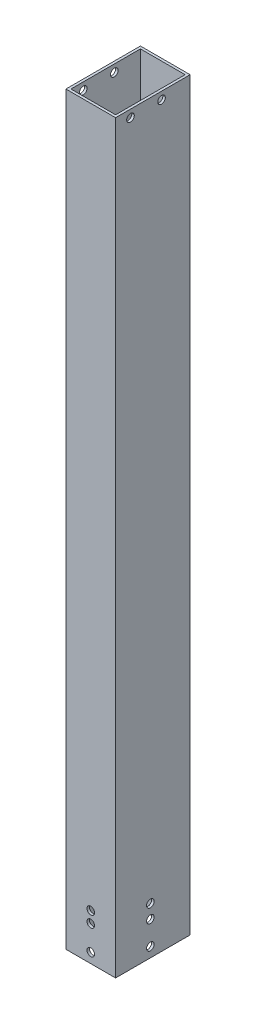
ISO-10303-21;
HEADER;
FILE_DESCRIPTION(('STEP AP214'),'2;1');
FILE_NAME('part.step','',(''),(''),'','','');
FILE_SCHEMA(('AUTOMOTIVE_DESIGN { 1 0 10303 214 1 1 1 1 }'));
ENDSEC;
DATA;
#1=APPLICATION_CONTEXT('core data for automotive mechanical design processes');
#2=APPLICATION_PROTOCOL_DEFINITION('international standard','automotive_design',2000,#1);
#3=PRODUCT_CONTEXT('',#1,'mechanical');
#4=PRODUCT('Part','Part','',(#3));
#5=PRODUCT_RELATED_PRODUCT_CATEGORY('part','',(#4));
#6=PRODUCT_DEFINITION_FORMATION('','',#4);
#7=PRODUCT_DEFINITION_CONTEXT('part definition',#1,'design');
#8=PRODUCT_DEFINITION('design','',#6,#7);
#9=PRODUCT_DEFINITION_SHAPE('','',#8);
#10=(LENGTH_UNIT() NAMED_UNIT(*) SI_UNIT(.MILLI.,.METRE.));
#11=(NAMED_UNIT(*) PLANE_ANGLE_UNIT() SI_UNIT($,.RADIAN.));
#12=(NAMED_UNIT(*) SI_UNIT($,.STERADIAN.) SOLID_ANGLE_UNIT());
#13=UNCERTAINTY_MEASURE_WITH_UNIT(LENGTH_MEASURE(1.E-05),#10,'distance_accuracy_value','');
#14=(GEOMETRIC_REPRESENTATION_CONTEXT(3) GLOBAL_UNCERTAINTY_ASSIGNED_CONTEXT((#13)) GLOBAL_UNIT_ASSIGNED_CONTEXT((#10,
#11,#12)) REPRESENTATION_CONTEXT('',''));
#15=CARTESIAN_POINT('',(0.,0.,0.));
#16=DIRECTION('',(0.,0.,1.));
#17=DIRECTION('',(1.,0.,0.));
#18=AXIS2_PLACEMENT_3D('',#15,#16,#17);
#19=CARTESIAN_POINT('',(10.,150.,15.));
#20=DIRECTION('',(-1.,0.,0.));
#21=DIRECTION('',(0.,0.,1.));
#22=AXIS2_PLACEMENT_3D('',#19,#20,#21);
#23=PLANE('',#22);
#24=CARTESIAN_POINT('',(10.,147.,9.0000000000055));
#25=DIRECTION('',(-1.,0.,0.));
#26=DIRECTION('',(0.,0.,1.));
#27=AXIS2_PLACEMENT_3D('',#24,#25,#26);
#28=CIRCLE('',#27,1.52499999991925);
#29=CARTESIAN_POINT('',(10.,147.,10.5249999999247));
#30=VERTEX_POINT('',#29);
#31=EDGE_CURVE('E191',#30,#30,#28,.T.);
#32=ORIENTED_EDGE('',*,*,#31,.T.);
#33=EDGE_LOOP('',(#32));
#34=FACE_BOUND('',#33,.T.);
#35=CARTESIAN_POINT('',(10.,147.,-3.49999999999451));
#36=DIRECTION('',(-1.,0.,0.));
#37=DIRECTION('',(0.,0.,1.));
#38=AXIS2_PLACEMENT_3D('',#35,#36,#37);
#39=CIRCLE('',#38,1.52499999991925);
#40=CARTESIAN_POINT('',(10.,147.,-1.97500000007526));
#41=VERTEX_POINT('',#40);
#42=EDGE_CURVE('E202',#41,#41,#39,.T.);
#43=ORIENTED_EDGE('',*,*,#42,.T.);
#44=EDGE_LOOP('',(#43));
#45=FACE_BOUND('',#44,.T.);
#46=CARTESIAN_POINT('',(10.,-136.499999999993,1.00000000000101));
#47=DIRECTION('',(1.,0.,0.));
#48=DIRECTION('',(0.,0.,-1.));
#49=AXIS2_PLACEMENT_3D('',#46,#47,#48);
#50=CIRCLE('',#49,1.52500000003684);
#51=CARTESIAN_POINT('',(10.,-136.499999999993,-0.525000000035833));
#52=VERTEX_POINT('',#51);
#53=EDGE_CURVE('E213',#52,#52,#50,.T.);
#54=ORIENTED_EDGE('',*,*,#53,.F.);
#55=EDGE_LOOP('',(#54));
#56=FACE_BOUND('',#55,.T.);
#57=CARTESIAN_POINT('',(10.,-130.999999999994,1.00000000000022));
#58=DIRECTION('',(1.,0.,0.));
#59=DIRECTION('',(0.,0.,-1.));
#60=AXIS2_PLACEMENT_3D('',#57,#58,#59);
#61=CIRCLE('',#60,1.52500000001426);
#62=CARTESIAN_POINT('',(10.,-130.999999999994,-0.525000000014038));
#63=VERTEX_POINT('',#62);
#64=EDGE_CURVE('E226',#63,#63,#61,.T.);
#65=ORIENTED_EDGE('',*,*,#64,.F.);
#66=EDGE_LOOP('',(#65));
#67=FACE_BOUND('',#66,.T.);
#68=CARTESIAN_POINT('',(10.,-146.,1.));
#69=DIRECTION('',(1.,0.,0.));
#70=DIRECTION('',(0.,0.,-1.));
#71=AXIS2_PLACEMENT_3D('',#68,#69,#70);
#72=CIRCLE('',#71,1.52500000000001);
#73=CARTESIAN_POINT('',(10.,-146.,-0.525000000000009));
#74=VERTEX_POINT('',#73);
#75=EDGE_CURVE('E247',#74,#74,#72,.T.);
#76=ORIENTED_EDGE('',*,*,#75,.F.);
#77=EDGE_LOOP('',(#76));
#78=FACE_BOUND('',#77,.T.);
#79=DIRECTION('',(0.,0.,-1.));
#80=VECTOR('',#79,1.);
#81=CARTESIAN_POINT('',(10.,-150.,15.));
#82=LINE('',#81,#80);
#83=CARTESIAN_POINT('',(10.,-150.,15.));
#84=VERTEX_POINT('',#83);
#85=CARTESIAN_POINT('',(10.,-150.,-15.));
#86=VERTEX_POINT('',#85);
#87=EDGE_CURVE('E136',#84,#86,#82,.T.);
#88=ORIENTED_EDGE('',*,*,#87,.T.);
#89=DIRECTION('',(0.,-1.,0.));
#90=VECTOR('',#89,1.);
#91=CARTESIAN_POINT('',(10.,150.,-15.));
#92=LINE('',#91,#90);
#93=CARTESIAN_POINT('',(10.,150.,-15.));
#94=VERTEX_POINT('',#93);
#95=EDGE_CURVE('E12',#94,#86,#92,.T.);
#96=ORIENTED_EDGE('',*,*,#95,.F.);
#97=DIRECTION('',(0.,0.,-1.));
#98=VECTOR('',#97,1.);
#99=CARTESIAN_POINT('',(10.,150.,15.));
#100=LINE('',#99,#98);
#101=CARTESIAN_POINT('',(10.,150.,15.));
#102=VERTEX_POINT('',#101);
#103=EDGE_CURVE('E140',#102,#94,#100,.T.);
#104=ORIENTED_EDGE('',*,*,#103,.F.);
#105=DIRECTION('',(0.,-1.,0.));
#106=VECTOR('',#105,1.);
#107=CARTESIAN_POINT('',(10.,150.,15.));
#108=LINE('',#107,#106);
#109=EDGE_CURVE('E150',#102,#84,#108,.T.);
#110=ORIENTED_EDGE('',*,*,#109,.T.);
#111=EDGE_LOOP('',(#88,#96,#104,#110));
#112=FACE_BOUND('',#111,.T.);
#113=ADVANCED_FACE('F34',(#34,#45,#56,#67,#78,#112),#23,.F.);
#114=CARTESIAN_POINT('',(-10.,150.,-15.));
#115=DIRECTION('',(0.,0.,1.));
#116=DIRECTION('',(1.,0.,0.));
#117=AXIS2_PLACEMENT_3D('',#114,#115,#116);
#118=PLANE('',#117);
#119=CARTESIAN_POINT('',(-6.65916974340597E-13,-136.,-15.));
#120=DIRECTION('',(0.,0.,1.));
#121=DIRECTION('',(1.,0.,0.));
#122=AXIS2_PLACEMENT_3D('',#119,#120,#121);
#123=CIRCLE('',#122,1.52500000000003);
#124=CARTESIAN_POINT('',(1.52499999999936,-136.,-15.));
#125=VERTEX_POINT('',#124);
#126=EDGE_CURVE('E178',#125,#125,#123,.T.);
#127=ORIENTED_EDGE('',*,*,#126,.T.);
#128=EDGE_LOOP('',(#127));
#129=FACE_BOUND('',#128,.T.);
#130=CARTESIAN_POINT('',(0.,-146.,-15.));
#131=DIRECTION('',(0.,0.,1.));
#132=DIRECTION('',(1.,0.,0.));
#133=AXIS2_PLACEMENT_3D('',#130,#131,#132);
#134=CIRCLE('',#133,1.52500000000001);
#135=CARTESIAN_POINT('',(1.52500000000001,-146.,-15.));
#136=VERTEX_POINT('',#135);
#137=EDGE_CURVE('E173',#136,#136,#134,.T.);
#138=ORIENTED_EDGE('',*,*,#137,.T.);
#139=EDGE_LOOP('',(#138));
#140=FACE_BOUND('',#139,.T.);
#141=DIRECTION('',(-1.,0.,0.));
#142=VECTOR('',#141,1.);
#143=CARTESIAN_POINT('',(-10.,-150.,-15.));
#144=LINE('',#143,#142);
#145=CARTESIAN_POINT('',(-10.,-150.,-15.));
#146=VERTEX_POINT('',#145);
#147=EDGE_CURVE('E153',#86,#146,#144,.T.);
#148=ORIENTED_EDGE('',*,*,#147,.T.);
#149=DIRECTION('',(0.,-1.,0.));
#150=VECTOR('',#149,1.);
#151=CARTESIAN_POINT('',(-10.,150.,-15.));
#152=LINE('',#151,#150);
#153=CARTESIAN_POINT('',(-10.,150.,-15.));
#154=VERTEX_POINT('',#153);
#155=EDGE_CURVE('E42',#154,#146,#152,.T.);
#156=ORIENTED_EDGE('',*,*,#155,.F.);
#157=DIRECTION('',(-1.,0.,0.));
#158=VECTOR('',#157,1.);
#159=CARTESIAN_POINT('',(-10.,150.,-15.));
#160=LINE('',#159,#158);
#161=EDGE_CURVE('E143',#94,#154,#160,.T.);
#162=ORIENTED_EDGE('',*,*,#161,.F.);
#163=ORIENTED_EDGE('',*,*,#95,.T.);
#164=EDGE_LOOP('',(#148,#156,#162,#163));
#165=FACE_BOUND('',#164,.T.);
#166=ADVANCED_FACE('F257',(#129,#140,#165),#118,.F.);
#167=CARTESIAN_POINT('',(-10.,150.,15.));
#168=DIRECTION('',(1.,0.,0.));
#169=DIRECTION('',(0.,0.,-1.));
#170=AXIS2_PLACEMENT_3D('',#167,#168,#169);
#171=PLANE('',#170);
#172=CARTESIAN_POINT('',(-10.,147.,9.0000000000055));
#173=DIRECTION('',(-1.,0.,0.));
#174=DIRECTION('',(0.,0.,1.));
#175=AXIS2_PLACEMENT_3D('',#172,#173,#174);
#176=CIRCLE('',#175,1.52499999991925);
#177=CARTESIAN_POINT('',(-10.,147.,10.5249999999247));
#178=VERTEX_POINT('',#177);
#179=EDGE_CURVE('E197',#178,#178,#176,.T.);
#180=ORIENTED_EDGE('',*,*,#179,.F.);
#181=EDGE_LOOP('',(#180));
#182=FACE_BOUND('',#181,.T.);
#183=CARTESIAN_POINT('',(-10.,147.,-3.49999999999451));
#184=DIRECTION('',(-1.,0.,0.));
#185=DIRECTION('',(0.,0.,1.));
#186=AXIS2_PLACEMENT_3D('',#183,#184,#185);
#187=CIRCLE('',#186,1.52499999991925);
#188=CARTESIAN_POINT('',(-10.,147.,-1.97500000007526));
#189=VERTEX_POINT('',#188);
#190=EDGE_CURVE('E205',#189,#189,#187,.T.);
#191=ORIENTED_EDGE('',*,*,#190,.F.);
#192=EDGE_LOOP('',(#191));
#193=FACE_BOUND('',#192,.T.);
#194=CARTESIAN_POINT('',(-10.,-136.499999999993,1.00000000000101));
#195=DIRECTION('',(1.,0.,0.));
#196=DIRECTION('',(0.,0.,-1.));
#197=AXIS2_PLACEMENT_3D('',#194,#195,#196);
#198=CIRCLE('',#197,1.52500000003684);
#199=CARTESIAN_POINT('',(-10.,-136.499999999993,-0.525000000035833));
#200=VERTEX_POINT('',#199);
#201=EDGE_CURVE('E187',#200,#200,#198,.T.);
#202=ORIENTED_EDGE('',*,*,#201,.T.);
#203=EDGE_LOOP('',(#202));
#204=FACE_BOUND('',#203,.T.);
#205=CARTESIAN_POINT('',(-10.,-130.999999999994,1.00000000000022));
#206=DIRECTION('',(1.,0.,0.));
#207=DIRECTION('',(0.,0.,-1.));
#208=AXIS2_PLACEMENT_3D('',#205,#206,#207);
#209=CIRCLE('',#208,1.52500000001426);
#210=CARTESIAN_POINT('',(-10.,-130.999999999994,-0.525000000014038));
#211=VERTEX_POINT('',#210);
#212=EDGE_CURVE('E183',#211,#211,#209,.T.);
#213=ORIENTED_EDGE('',*,*,#212,.T.);
#214=EDGE_LOOP('',(#213));
#215=FACE_BOUND('',#214,.T.);
#216=CARTESIAN_POINT('',(-10.,-146.,1.));
#217=DIRECTION('',(1.,0.,0.));
#218=DIRECTION('',(0.,0.,-1.));
#219=AXIS2_PLACEMENT_3D('',#216,#217,#218);
#220=CIRCLE('',#219,1.52500000000001);
#221=CARTESIAN_POINT('',(-10.,-146.,-0.525000000000009));
#222=VERTEX_POINT('',#221);
#223=EDGE_CURVE('E168',#222,#222,#220,.T.);
#224=ORIENTED_EDGE('',*,*,#223,.T.);
#225=EDGE_LOOP('',(#224));
#226=FACE_BOUND('',#225,.T.);
#227=DIRECTION('',(0.,0.,1.));
#228=VECTOR('',#227,1.);
#229=CARTESIAN_POINT('',(-10.,-150.,15.));
#230=LINE('',#229,#228);
#231=CARTESIAN_POINT('',(-10.,-150.,15.));
#232=VERTEX_POINT('',#231);
#233=EDGE_CURVE('E155',#146,#232,#230,.T.);
#234=ORIENTED_EDGE('',*,*,#233,.T.);
#235=DIRECTION('',(0.,-1.,0.));
#236=VECTOR('',#235,1.);
#237=CARTESIAN_POINT('',(-10.,150.,15.));
#238=LINE('',#237,#236);
#239=CARTESIAN_POINT('',(-10.,150.,15.));
#240=VERTEX_POINT('',#239);
#241=EDGE_CURVE('E160',#240,#232,#238,.T.);
#242=ORIENTED_EDGE('',*,*,#241,.F.);
#243=DIRECTION('',(0.,0.,1.));
#244=VECTOR('',#243,1.);
#245=CARTESIAN_POINT('',(-10.,150.,15.));
#246=LINE('',#245,#244);
#247=EDGE_CURVE('E146',#154,#240,#246,.T.);
#248=ORIENTED_EDGE('',*,*,#247,.F.);
#249=ORIENTED_EDGE('',*,*,#155,.T.);
#250=EDGE_LOOP('',(#234,#242,#248,#249));
#251=FACE_BOUND('',#250,.T.);
#252=ADVANCED_FACE('F274',(#182,#193,#204,#215,#226,#251),#171,.F.);
#253=CARTESIAN_POINT('',(-10.,150.,15.));
#254=DIRECTION('',(0.,0.,-1.));
#255=DIRECTION('',(-1.,0.,0.));
#256=AXIS2_PLACEMENT_3D('',#253,#254,#255);
#257=PLANE('',#256);
#258=CARTESIAN_POINT('',(-4.33464028559705E-13,-131.5,15.));
#259=DIRECTION('',(0.,0.,1.));
#260=DIRECTION('',(1.,0.,0.));
#261=AXIS2_PLACEMENT_3D('',#258,#259,#260);
#262=CIRCLE('',#261,1.52500000000001);
#263=CARTESIAN_POINT('',(1.52499999999958,-131.5,15.));
#264=VERTEX_POINT('',#263);
#265=EDGE_CURVE('E220',#264,#264,#262,.T.);
#266=ORIENTED_EDGE('',*,*,#265,.F.);
#267=EDGE_LOOP('',(#266));
#268=FACE_BOUND('',#267,.T.);
#269=CARTESIAN_POINT('',(-6.65916974340597E-13,-136.,15.));
#270=DIRECTION('',(0.,0.,1.));
#271=DIRECTION('',(1.,0.,0.));
#272=AXIS2_PLACEMENT_3D('',#269,#270,#271);
#273=CIRCLE('',#272,1.52500000000003);
#274=CARTESIAN_POINT('',(1.52499999999936,-136.,15.));
#275=VERTEX_POINT('',#274);
#276=EDGE_CURVE('E233',#275,#275,#273,.T.);
#277=ORIENTED_EDGE('',*,*,#276,.F.);
#278=EDGE_LOOP('',(#277));
#279=FACE_BOUND('',#278,.T.);
#280=CARTESIAN_POINT('',(0.,-146.,15.));
#281=DIRECTION('',(0.,0.,1.));
#282=DIRECTION('',(1.,0.,0.));
#283=AXIS2_PLACEMENT_3D('',#280,#281,#282);
#284=CIRCLE('',#283,1.52500000000001);
#285=CARTESIAN_POINT('',(1.52500000000001,-146.,15.));
#286=VERTEX_POINT('',#285);
#287=EDGE_CURVE('E240',#286,#286,#284,.T.);
#288=ORIENTED_EDGE('',*,*,#287,.F.);
#289=EDGE_LOOP('',(#288));
#290=FACE_BOUND('',#289,.T.);
#291=DIRECTION('',(1.,0.,0.));
#292=VECTOR('',#291,1.);
#293=CARTESIAN_POINT('',(-10.,-150.,15.));
#294=LINE('',#293,#292);
#295=EDGE_CURVE('E144',#232,#84,#294,.T.);
#296=ORIENTED_EDGE('',*,*,#295,.T.);
#297=ORIENTED_EDGE('',*,*,#109,.F.);
#298=DIRECTION('',(1.,0.,0.));
#299=VECTOR('',#298,1.);
#300=CARTESIAN_POINT('',(-10.,150.,15.));
#301=LINE('',#300,#299);
#302=EDGE_CURVE('E148',#240,#102,#301,.T.);
#303=ORIENTED_EDGE('',*,*,#302,.F.);
#304=ORIENTED_EDGE('',*,*,#241,.T.);
#305=EDGE_LOOP('',(#296,#297,#303,#304));
#306=FACE_BOUND('',#305,.T.);
#307=ADVANCED_FACE('F272',(#268,#279,#290,#306),#257,.F.);
#308=CARTESIAN_POINT('',(0.,150.,0.));
#309=DIRECTION('',(0.,-1.,0.));
#310=DIRECTION('',(0.,0.,-1.));
#311=AXIS2_PLACEMENT_3D('',#308,#309,#310);
#312=PLANE('',#311);
#313=DIRECTION('',(0.,0.,-1.));
#314=VECTOR('',#313,1.);
#315=CARTESIAN_POINT('',(9.,150.,14.));
#316=LINE('',#315,#314);
#317=CARTESIAN_POINT('',(9.,150.,14.));
#318=VERTEX_POINT('',#317);
#319=CARTESIAN_POINT('',(9.,150.,-14.));
#320=VERTEX_POINT('',#319);
#321=EDGE_CURVE('E130',#318,#320,#316,.T.);
#322=ORIENTED_EDGE('',*,*,#321,.F.);
#323=DIRECTION('',(1.,0.,0.));
#324=VECTOR('',#323,1.);
#325=CARTESIAN_POINT('',(-9.,150.,14.));
#326=LINE('',#325,#324);
#327=CARTESIAN_POINT('',(-9.,150.,14.));
#328=VERTEX_POINT('',#327);
#329=EDGE_CURVE('E50',#328,#318,#326,.T.);
#330=ORIENTED_EDGE('',*,*,#329,.F.);
#331=DIRECTION('',(0.,0.,1.));
#332=VECTOR('',#331,1.);
#333=CARTESIAN_POINT('',(-9.,150.,-14.));
#334=LINE('',#333,#332);
#335=CARTESIAN_POINT('',(-9.,150.,-14.));
#336=VERTEX_POINT('',#335);
#337=EDGE_CURVE('E118',#336,#328,#334,.T.);
#338=ORIENTED_EDGE('',*,*,#337,.F.);
#339=DIRECTION('',(-1.,0.,0.));
#340=VECTOR('',#339,1.);
#341=CARTESIAN_POINT('',(9.,150.,-14.));
#342=LINE('',#341,#340);
#343=EDGE_CURVE('E121',#320,#336,#342,.T.);
#344=ORIENTED_EDGE('',*,*,#343,.F.);
#345=EDGE_LOOP('',(#322,#330,#338,#344));
#346=FACE_BOUND('',#345,.T.);
#347=ORIENTED_EDGE('',*,*,#103,.T.);
#348=ORIENTED_EDGE('',*,*,#161,.T.);
#349=ORIENTED_EDGE('',*,*,#247,.T.);
#350=ORIENTED_EDGE('',*,*,#302,.T.);
#351=EDGE_LOOP('',(#347,#348,#349,#350));
#352=FACE_BOUND('',#351,.T.);
#353=ADVANCED_FACE('F268',(#346,#352),#312,.F.);
#354=CARTESIAN_POINT('',(0.,-150.,0.));
#355=DIRECTION('',(0.,-1.,0.));
#356=DIRECTION('',(0.,0.,-1.));
#357=AXIS2_PLACEMENT_3D('',#354,#355,#356);
#358=PLANE('',#357);
#359=DIRECTION('',(1.,0.,0.));
#360=VECTOR('',#359,1.);
#361=CARTESIAN_POINT('',(-9.,-150.,14.));
#362=LINE('',#361,#360);
#363=CARTESIAN_POINT('',(-9.,-150.,14.));
#364=VERTEX_POINT('',#363);
#365=CARTESIAN_POINT('',(9.,-150.,14.));
#366=VERTEX_POINT('',#365);
#367=EDGE_CURVE('E102',#364,#366,#362,.T.);
#368=ORIENTED_EDGE('',*,*,#367,.T.);
#369=DIRECTION('',(0.,0.,-1.));
#370=VECTOR('',#369,1.);
#371=CARTESIAN_POINT('',(9.,-150.,14.));
#372=LINE('',#371,#370);
#373=CARTESIAN_POINT('',(9.,-150.,-14.));
#374=VERTEX_POINT('',#373);
#375=EDGE_CURVE('E111',#366,#374,#372,.T.);
#376=ORIENTED_EDGE('',*,*,#375,.T.);
#377=DIRECTION('',(-1.,0.,0.));
#378=VECTOR('',#377,1.);
#379=CARTESIAN_POINT('',(9.,-150.,-14.));
#380=LINE('',#379,#378);
#381=CARTESIAN_POINT('',(-9.,-150.,-14.));
#382=VERTEX_POINT('',#381);
#383=EDGE_CURVE('E58',#374,#382,#380,.T.);
#384=ORIENTED_EDGE('',*,*,#383,.T.);
#385=DIRECTION('',(0.,0.,1.));
#386=VECTOR('',#385,1.);
#387=CARTESIAN_POINT('',(-9.,-150.,-14.));
#388=LINE('',#387,#386);
#389=EDGE_CURVE('E108',#382,#364,#388,.T.);
#390=ORIENTED_EDGE('',*,*,#389,.T.);
#391=EDGE_LOOP('',(#368,#376,#384,#390));
#392=FACE_BOUND('',#391,.T.);
#393=ORIENTED_EDGE('',*,*,#87,.F.);
#394=ORIENTED_EDGE('',*,*,#295,.F.);
#395=ORIENTED_EDGE('',*,*,#233,.F.);
#396=ORIENTED_EDGE('',*,*,#147,.F.);
#397=EDGE_LOOP('',(#393,#394,#395,#396));
#398=FACE_BOUND('',#397,.T.);
#399=ADVANCED_FACE('F115',(#392,#398),#358,.T.);
#400=CARTESIAN_POINT('',(-9.,-150.,14.));
#401=DIRECTION('',(0.,0.,1.));
#402=DIRECTION('',(1.,0.,0.));
#403=AXIS2_PLACEMENT_3D('',#400,#401,#402);
#404=PLANE('',#403);
#405=CARTESIAN_POINT('',(-4.33464028559705E-13,-131.5,14.));
#406=DIRECTION('',(0.,0.,1.));
#407=DIRECTION('',(1.,0.,0.));
#408=AXIS2_PLACEMENT_3D('',#405,#406,#407);
#409=CIRCLE('',#408,1.52500000000001);
#410=CARTESIAN_POINT('',(1.52499999999958,-131.5,14.));
#411=VERTEX_POINT('',#410);
#412=EDGE_CURVE('E223',#411,#411,#409,.F.);
#413=ORIENTED_EDGE('',*,*,#412,.F.);
#414=EDGE_LOOP('',(#413));
#415=FACE_BOUND('',#414,.T.);
#416=CARTESIAN_POINT('',(-6.65916974340597E-13,-136.,14.));
#417=DIRECTION('',(0.,0.,1.));
#418=DIRECTION('',(1.,0.,0.));
#419=AXIS2_PLACEMENT_3D('',#416,#417,#418);
#420=CIRCLE('',#419,1.52500000000003);
#421=CARTESIAN_POINT('',(1.52499999999936,-136.,14.));
#422=VERTEX_POINT('',#421);
#423=EDGE_CURVE('E177',#422,#422,#420,.T.);
#424=ORIENTED_EDGE('',*,*,#423,.T.);
#425=EDGE_LOOP('',(#424));
#426=FACE_BOUND('',#425,.T.);
#427=CARTESIAN_POINT('',(0.,-146.,14.));
#428=DIRECTION('',(0.,0.,1.));
#429=DIRECTION('',(1.,0.,0.));
#430=AXIS2_PLACEMENT_3D('',#427,#428,#429);
#431=CIRCLE('',#430,1.52500000000001);
#432=CARTESIAN_POINT('',(1.52500000000001,-146.,14.));
#433=VERTEX_POINT('',#432);
#434=EDGE_CURVE('E172',#433,#433,#431,.T.);
#435=ORIENTED_EDGE('',*,*,#434,.T.);
#436=EDGE_LOOP('',(#435));
#437=FACE_BOUND('',#436,.T.);
#438=ORIENTED_EDGE('',*,*,#329,.T.);
#439=DIRECTION('',(0.,1.,0.));
#440=VECTOR('',#439,1.);
#441=CARTESIAN_POINT('',(9.,-150.,14.));
#442=LINE('',#441,#440);
#443=EDGE_CURVE('E98',#366,#318,#442,.T.);
#444=ORIENTED_EDGE('',*,*,#443,.F.);
#445=ORIENTED_EDGE('',*,*,#367,.F.);
#446=DIRECTION('',(0.,1.,0.));
#447=VECTOR('',#446,1.);
#448=CARTESIAN_POINT('',(-9.,-150.,14.));
#449=LINE('',#448,#447);
#450=EDGE_CURVE('E134',#364,#328,#449,.T.);
#451=ORIENTED_EDGE('',*,*,#450,.T.);
#452=EDGE_LOOP('',(#438,#444,#445,#451));
#453=FACE_BOUND('',#452,.T.);
#454=ADVANCED_FACE('F100',(#415,#426,#437,#453),#404,.F.);
#455=CARTESIAN_POINT('',(-9.,-150.,-14.));
#456=DIRECTION('',(-1.,0.,0.));
#457=DIRECTION('',(0.,0.,1.));
#458=AXIS2_PLACEMENT_3D('',#455,#456,#457);
#459=PLANE('',#458);
#460=CARTESIAN_POINT('',(-9.,147.,9.0000000000055));
#461=DIRECTION('',(-1.,0.,0.));
#462=DIRECTION('',(0.,0.,1.));
#463=AXIS2_PLACEMENT_3D('',#460,#461,#462);
#464=CIRCLE('',#463,1.52499999991925);
#465=CARTESIAN_POINT('',(-9.,147.,10.5249999999247));
#466=VERTEX_POINT('',#465);
#467=EDGE_CURVE('E210',#466,#466,#464,.T.);
#468=ORIENTED_EDGE('',*,*,#467,.T.);
#469=EDGE_LOOP('',(#468));
#470=FACE_BOUND('',#469,.T.);
#471=CARTESIAN_POINT('',(-9.,147.,-3.49999999999451));
#472=DIRECTION('',(-1.,0.,0.));
#473=DIRECTION('',(0.,0.,1.));
#474=AXIS2_PLACEMENT_3D('',#471,#472,#473);
#475=CIRCLE('',#474,1.52499999991925);
#476=CARTESIAN_POINT('',(-9.,147.,-1.97500000007526));
#477=VERTEX_POINT('',#476);
#478=EDGE_CURVE('E190',#477,#477,#475,.T.);
#479=ORIENTED_EDGE('',*,*,#478,.T.);
#480=EDGE_LOOP('',(#479));
#481=FACE_BOUND('',#480,.T.);
#482=CARTESIAN_POINT('',(-9.,-136.499999999993,1.00000000000101));
#483=DIRECTION('',(-1.,0.,0.));
#484=DIRECTION('',(0.,0.,1.));
#485=AXIS2_PLACEMENT_3D('',#482,#483,#484);
#486=CIRCLE('',#485,1.52500000003684);
#487=CARTESIAN_POINT('',(-9.,-136.499999999993,2.52500000003785));
#488=VERTEX_POINT('',#487);
#489=EDGE_CURVE('E186',#488,#488,#486,.T.);
#490=ORIENTED_EDGE('',*,*,#489,.T.);
#491=EDGE_LOOP('',(#490));
#492=FACE_BOUND('',#491,.T.);
#493=CARTESIAN_POINT('',(-9.,-130.999999999994,1.00000000000022));
#494=DIRECTION('',(-1.,0.,0.));
#495=DIRECTION('',(0.,0.,1.));
#496=AXIS2_PLACEMENT_3D('',#493,#494,#495);
#497=CIRCLE('',#496,1.52500000001426);
#498=CARTESIAN_POINT('',(-9.,-130.999999999994,2.52500000001447));
#499=VERTEX_POINT('',#498);
#500=EDGE_CURVE('E182',#499,#499,#497,.T.);
#501=ORIENTED_EDGE('',*,*,#500,.T.);
#502=EDGE_LOOP('',(#501));
#503=FACE_BOUND('',#502,.T.);
#504=CARTESIAN_POINT('',(-9.,-146.,1.));
#505=DIRECTION('',(-1.,0.,0.));
#506=DIRECTION('',(0.,0.,1.));
#507=AXIS2_PLACEMENT_3D('',#504,#505,#506);
#508=CIRCLE('',#507,1.52500000000001);
#509=CARTESIAN_POINT('',(-9.,-146.,2.52500000000001));
#510=VERTEX_POINT('',#509);
#511=EDGE_CURVE('E124',#510,#510,#508,.T.);
#512=ORIENTED_EDGE('',*,*,#511,.T.);
#513=EDGE_LOOP('',(#512));
#514=FACE_BOUND('',#513,.T.);
#515=ORIENTED_EDGE('',*,*,#337,.T.);
#516=ORIENTED_EDGE('',*,*,#450,.F.);
#517=ORIENTED_EDGE('',*,*,#389,.F.);
#518=DIRECTION('',(0.,1.,0.));
#519=VECTOR('',#518,1.);
#520=CARTESIAN_POINT('',(-9.,-150.,-14.));
#521=LINE('',#520,#519);
#522=EDGE_CURVE('E137',#382,#336,#521,.T.);
#523=ORIENTED_EDGE('',*,*,#522,.T.);
#524=EDGE_LOOP('',(#515,#516,#517,#523));
#525=FACE_BOUND('',#524,.T.);
#526=ADVANCED_FACE('F295',(#470,#481,#492,#503,#514,#525),#459,.F.);
#527=CARTESIAN_POINT('',(9.,-150.,-14.));
#528=DIRECTION('',(0.,0.,-1.));
#529=DIRECTION('',(-1.,0.,0.));
#530=AXIS2_PLACEMENT_3D('',#527,#528,#529);
#531=PLANE('',#530);
#532=CARTESIAN_POINT('',(-6.65916974340597E-13,-136.,-14.));
#533=DIRECTION('',(0.,0.,-1.));
#534=DIRECTION('',(-1.,0.,0.));
#535=AXIS2_PLACEMENT_3D('',#532,#533,#534);
#536=CIRCLE('',#535,1.52500000000003);
#537=CARTESIAN_POINT('',(-1.52500000000069,-136.,-14.));
#538=VERTEX_POINT('',#537);
#539=EDGE_CURVE('E174',#538,#538,#536,.T.);
#540=ORIENTED_EDGE('',*,*,#539,.T.);
#541=EDGE_LOOP('',(#540));
#542=FACE_BOUND('',#541,.T.);
#543=CARTESIAN_POINT('',(0.,-146.,-14.));
#544=DIRECTION('',(0.,0.,-1.));
#545=DIRECTION('',(-1.,0.,0.));
#546=AXIS2_PLACEMENT_3D('',#543,#544,#545);
#547=CIRCLE('',#546,1.52500000000001);
#548=CARTESIAN_POINT('',(-1.52500000000001,-146.,-14.));
#549=VERTEX_POINT('',#548);
#550=EDGE_CURVE('E169',#549,#549,#547,.T.);
#551=ORIENTED_EDGE('',*,*,#550,.T.);
#552=EDGE_LOOP('',(#551));
#553=FACE_BOUND('',#552,.T.);
#554=ORIENTED_EDGE('',*,*,#343,.T.);
#555=ORIENTED_EDGE('',*,*,#522,.F.);
#556=ORIENTED_EDGE('',*,*,#383,.F.);
#557=DIRECTION('',(0.,1.,0.));
#558=VECTOR('',#557,1.);
#559=CARTESIAN_POINT('',(9.,-150.,-14.));
#560=LINE('',#559,#558);
#561=EDGE_CURVE('E107',#374,#320,#560,.T.);
#562=ORIENTED_EDGE('',*,*,#561,.T.);
#563=EDGE_LOOP('',(#554,#555,#556,#562));
#564=FACE_BOUND('',#563,.T.);
#565=ADVANCED_FACE('F299',(#542,#553,#564),#531,.F.);
#566=CARTESIAN_POINT('',(9.,-150.,14.));
#567=DIRECTION('',(1.,0.,0.));
#568=DIRECTION('',(0.,0.,-1.));
#569=AXIS2_PLACEMENT_3D('',#566,#567,#568);
#570=PLANE('',#569);
#571=CARTESIAN_POINT('',(9.,147.,9.0000000000055));
#572=DIRECTION('',(1.,0.,0.));
#573=DIRECTION('',(0.,0.,-1.));
#574=AXIS2_PLACEMENT_3D('',#571,#572,#573);
#575=CIRCLE('',#574,1.52499999991925);
#576=CARTESIAN_POINT('',(9.,147.,7.47500000008625));
#577=VERTEX_POINT('',#576);
#578=EDGE_CURVE('E37',#577,#577,#575,.T.);
#579=ORIENTED_EDGE('',*,*,#578,.T.);
#580=EDGE_LOOP('',(#579));
#581=FACE_BOUND('',#580,.T.);
#582=CARTESIAN_POINT('',(9.,147.,-3.49999999999451));
#583=DIRECTION('',(1.,0.,0.));
#584=DIRECTION('',(0.,0.,-1.));
#585=AXIS2_PLACEMENT_3D('',#582,#583,#584);
#586=CIRCLE('',#585,1.52499999991925);
#587=CARTESIAN_POINT('',(9.,147.,-5.02499999991375));
#588=VERTEX_POINT('',#587);
#589=EDGE_CURVE('E188',#588,#588,#586,.T.);
#590=ORIENTED_EDGE('',*,*,#589,.T.);
#591=EDGE_LOOP('',(#590));
#592=FACE_BOUND('',#591,.T.);
#593=CARTESIAN_POINT('',(9.,-136.499999999993,1.00000000000101));
#594=DIRECTION('',(1.,0.,0.));
#595=DIRECTION('',(0.,0.,-1.));
#596=AXIS2_PLACEMENT_3D('',#593,#594,#595);
#597=CIRCLE('',#596,1.52500000003684);
#598=CARTESIAN_POINT('',(9.,-136.499999999993,-0.525000000035833));
#599=VERTEX_POINT('',#598);
#600=EDGE_CURVE('E184',#599,#599,#597,.T.);
#601=ORIENTED_EDGE('',*,*,#600,.T.);
#602=EDGE_LOOP('',(#601));
#603=FACE_BOUND('',#602,.T.);
#604=CARTESIAN_POINT('',(9.,-130.999999999994,1.00000000000022));
#605=DIRECTION('',(1.,0.,0.));
#606=DIRECTION('',(0.,0.,-1.));
#607=AXIS2_PLACEMENT_3D('',#604,#605,#606);
#608=CIRCLE('',#607,1.52500000001426);
#609=CARTESIAN_POINT('',(9.,-130.999999999994,-0.525000000014038));
#610=VERTEX_POINT('',#609);
#611=EDGE_CURVE('E179',#610,#610,#608,.T.);
#612=ORIENTED_EDGE('',*,*,#611,.T.);
#613=EDGE_LOOP('',(#612));
#614=FACE_BOUND('',#613,.T.);
#615=CARTESIAN_POINT('',(9.,-146.,1.));
#616=DIRECTION('',(1.,0.,0.));
#617=DIRECTION('',(0.,0.,-1.));
#618=AXIS2_PLACEMENT_3D('',#615,#616,#617);
#619=CIRCLE('',#618,1.52500000000001);
#620=CARTESIAN_POINT('',(9.,-146.,-0.525000000000009));
#621=VERTEX_POINT('',#620);
#622=EDGE_CURVE('E165',#621,#621,#619,.T.);
#623=ORIENTED_EDGE('',*,*,#622,.T.);
#624=EDGE_LOOP('',(#623));
#625=FACE_BOUND('',#624,.T.);
#626=ORIENTED_EDGE('',*,*,#321,.T.);
#627=ORIENTED_EDGE('',*,*,#561,.F.);
#628=ORIENTED_EDGE('',*,*,#375,.F.);
#629=ORIENTED_EDGE('',*,*,#443,.T.);
#630=EDGE_LOOP('',(#626,#627,#628,#629));
#631=FACE_BOUND('',#630,.T.);
#632=ADVANCED_FACE('F112',(#581,#592,#603,#614,#625,#631),#570,.F.);
#633=CARTESIAN_POINT('',(-10.,-146.,1.));
#634=DIRECTION('',(1.,0.,0.));
#635=DIRECTION('',(0.,0.,-1.));
#636=AXIS2_PLACEMENT_3D('',#633,#634,#635);
#637=CYLINDRICAL_SURFACE('',#636,1.52500000000001);
#638=ORIENTED_EDGE('',*,*,#75,.T.);
#639=EDGE_LOOP('',(#638));
#640=FACE_BOUND('',#639,.T.);
#641=ORIENTED_EDGE('',*,*,#622,.F.);
#642=EDGE_LOOP('',(#641));
#643=FACE_BOUND('',#642,.T.);
#644=ADVANCED_FACE('F252',(#640,#643),#637,.F.);
#645=ORIENTED_EDGE('',*,*,#223,.F.);
#646=EDGE_LOOP('',(#645));
#647=FACE_BOUND('',#646,.T.);
#648=ORIENTED_EDGE('',*,*,#511,.F.);
#649=EDGE_LOOP('',(#648));
#650=FACE_BOUND('',#649,.T.);
#651=ADVANCED_FACE('F307',(#647,#650),#637,.F.);
#652=CARTESIAN_POINT('',(0.,-146.,-15.));
#653=DIRECTION('',(0.,0.,1.));
#654=DIRECTION('',(1.,0.,0.));
#655=AXIS2_PLACEMENT_3D('',#652,#653,#654);
#656=CYLINDRICAL_SURFACE('',#655,1.52500000000001);
#657=ORIENTED_EDGE('',*,*,#137,.F.);
#658=EDGE_LOOP('',(#657));
#659=FACE_BOUND('',#658,.T.);
#660=ORIENTED_EDGE('',*,*,#550,.F.);
#661=EDGE_LOOP('',(#660));
#662=FACE_BOUND('',#661,.T.);
#663=ADVANCED_FACE('F310',(#659,#662),#656,.F.);
#664=ORIENTED_EDGE('',*,*,#287,.T.);
#665=EDGE_LOOP('',(#664));
#666=FACE_BOUND('',#665,.T.);
#667=ORIENTED_EDGE('',*,*,#434,.F.);
#668=EDGE_LOOP('',(#667));
#669=FACE_BOUND('',#668,.T.);
#670=ADVANCED_FACE('F312',(#666,#669),#656,.F.);
#671=CARTESIAN_POINT('',(-6.65916974340597E-13,-136.,-15.));
#672=DIRECTION('',(0.,0.,1.));
#673=DIRECTION('',(1.,0.,0.));
#674=AXIS2_PLACEMENT_3D('',#671,#672,#673);
#675=CYLINDRICAL_SURFACE('',#674,1.52500000000003);
#676=ORIENTED_EDGE('',*,*,#126,.F.);
#677=EDGE_LOOP('',(#676));
#678=FACE_BOUND('',#677,.T.);
#679=ORIENTED_EDGE('',*,*,#539,.F.);
#680=EDGE_LOOP('',(#679));
#681=FACE_BOUND('',#680,.T.);
#682=ADVANCED_FACE('F315',(#678,#681),#675,.F.);
#683=ORIENTED_EDGE('',*,*,#276,.T.);
#684=EDGE_LOOP('',(#683));
#685=FACE_BOUND('',#684,.T.);
#686=ORIENTED_EDGE('',*,*,#423,.F.);
#687=EDGE_LOOP('',(#686));
#688=FACE_BOUND('',#687,.T.);
#689=ADVANCED_FACE('F317',(#685,#688),#675,.F.);
#690=CARTESIAN_POINT('',(-10.,-130.999999999994,1.00000000000022));
#691=DIRECTION('',(1.,0.,0.));
#692=DIRECTION('',(0.,0.,-1.));
#693=AXIS2_PLACEMENT_3D('',#690,#691,#692);
#694=CYLINDRICAL_SURFACE('',#693,1.52500000001426);
#695=ORIENTED_EDGE('',*,*,#64,.T.);
#696=EDGE_LOOP('',(#695));
#697=FACE_BOUND('',#696,.T.);
#698=ORIENTED_EDGE('',*,*,#611,.F.);
#699=EDGE_LOOP('',(#698));
#700=FACE_BOUND('',#699,.T.);
#701=ADVANCED_FACE('F320',(#697,#700),#694,.F.);
#702=ORIENTED_EDGE('',*,*,#212,.F.);
#703=EDGE_LOOP('',(#702));
#704=FACE_BOUND('',#703,.T.);
#705=ORIENTED_EDGE('',*,*,#500,.F.);
#706=EDGE_LOOP('',(#705));
#707=FACE_BOUND('',#706,.T.);
#708=ADVANCED_FACE('F322',(#704,#707),#694,.F.);
#709=CARTESIAN_POINT('',(-4.33464028559705E-13,-131.5,-15.001));
#710=DIRECTION('',(0.,0.,1.));
#711=DIRECTION('',(1.,0.,0.));
#712=AXIS2_PLACEMENT_3D('',#709,#710,#711);
#713=CYLINDRICAL_SURFACE('',#712,1.52500000000001);
#714=ORIENTED_EDGE('',*,*,#265,.T.);
#715=EDGE_LOOP('',(#714));
#716=FACE_BOUND('',#715,.T.);
#717=ORIENTED_EDGE('',*,*,#412,.T.);
#718=EDGE_LOOP('',(#717));
#719=FACE_BOUND('',#718,.T.);
#720=ADVANCED_FACE('F325',(#716,#719),#713,.F.);
#721=CARTESIAN_POINT('',(-10.,-136.499999999993,1.00000000000101));
#722=DIRECTION('',(1.,0.,0.));
#723=DIRECTION('',(0.,0.,-1.));
#724=AXIS2_PLACEMENT_3D('',#721,#722,#723);
#725=CYLINDRICAL_SURFACE('',#724,1.52500000003684);
#726=ORIENTED_EDGE('',*,*,#53,.T.);
#727=EDGE_LOOP('',(#726));
#728=FACE_BOUND('',#727,.T.);
#729=ORIENTED_EDGE('',*,*,#600,.F.);
#730=EDGE_LOOP('',(#729));
#731=FACE_BOUND('',#730,.T.);
#732=ADVANCED_FACE('F329',(#728,#731),#725,.F.);
#733=ORIENTED_EDGE('',*,*,#201,.F.);
#734=EDGE_LOOP('',(#733));
#735=FACE_BOUND('',#734,.T.);
#736=ORIENTED_EDGE('',*,*,#489,.F.);
#737=EDGE_LOOP('',(#736));
#738=FACE_BOUND('',#737,.T.);
#739=ADVANCED_FACE('F331',(#735,#738),#725,.F.);
#740=CARTESIAN_POINT('',(10.,147.,-3.49999999999451));
#741=DIRECTION('',(-1.,0.,0.));
#742=DIRECTION('',(0.,0.,1.));
#743=AXIS2_PLACEMENT_3D('',#740,#741,#742);
#744=CYLINDRICAL_SURFACE('',#743,1.52499999991925);
#745=ORIENTED_EDGE('',*,*,#42,.F.);
#746=EDGE_LOOP('',(#745));
#747=FACE_BOUND('',#746,.T.);
#748=ORIENTED_EDGE('',*,*,#589,.F.);
#749=EDGE_LOOP('',(#748));
#750=FACE_BOUND('',#749,.T.);
#751=ADVANCED_FACE('F334',(#747,#750),#744,.F.);
#752=CARTESIAN_POINT('',(10.,147.,9.0000000000055));
#753=DIRECTION('',(-1.,0.,0.));
#754=DIRECTION('',(0.,0.,1.));
#755=AXIS2_PLACEMENT_3D('',#752,#753,#754);
#756=CYLINDRICAL_SURFACE('',#755,1.52499999991925);
#757=ORIENTED_EDGE('',*,*,#31,.F.);
#758=EDGE_LOOP('',(#757));
#759=FACE_BOUND('',#758,.T.);
#760=ORIENTED_EDGE('',*,*,#578,.F.);
#761=EDGE_LOOP('',(#760));
#762=FACE_BOUND('',#761,.T.);
#763=ADVANCED_FACE('F340',(#759,#762),#756,.F.);
#764=ORIENTED_EDGE('',*,*,#190,.T.);
#765=EDGE_LOOP('',(#764));
#766=FACE_BOUND('',#765,.T.);
#767=ORIENTED_EDGE('',*,*,#478,.F.);
#768=EDGE_LOOP('',(#767));
#769=FACE_BOUND('',#768,.T.);
#770=ADVANCED_FACE('F336',(#766,#769),#744,.F.);
#771=ORIENTED_EDGE('',*,*,#179,.T.);
#772=EDGE_LOOP('',(#771));
#773=FACE_BOUND('',#772,.T.);
#774=ORIENTED_EDGE('',*,*,#467,.F.);
#775=EDGE_LOOP('',(#774));
#776=FACE_BOUND('',#775,.T.);
#777=ADVANCED_FACE('F339',(#773,#776),#756,.F.);
#778=CLOSED_SHELL('',(#113,#166,#252,#307,#353,#399,#454,#526,#565,#632,#644,#651,#663,#670,
#682,#689,#701,#708,#720,#732,#739,#751,#763,#770,#777));
#779=MANIFOLD_SOLID_BREP('B2',#778);
#780=ADVANCED_BREP_SHAPE_REPRESENTATION('',(#18,#779),#14);
#781=SHAPE_DEFINITION_REPRESENTATION(#9,#780);
ENDSEC;
END-ISO-10303-21;
